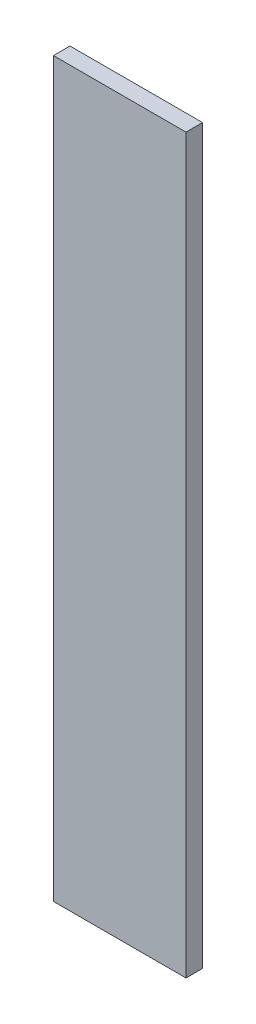
ISO-10303-21;
HEADER;
FILE_DESCRIPTION(('STEP AP214'),'2;1');
FILE_NAME('part.step','',(''),(''),'','','');
FILE_SCHEMA(('AUTOMOTIVE_DESIGN { 1 0 10303 214 1 1 1 1 }'));
ENDSEC;
DATA;
#1=APPLICATION_CONTEXT('core data for automotive mechanical design processes');
#2=APPLICATION_PROTOCOL_DEFINITION('international standard','automotive_design',2000,#1);
#3=PRODUCT_CONTEXT('',#1,'mechanical');
#4=PRODUCT('Part','Part','',(#3));
#5=PRODUCT_RELATED_PRODUCT_CATEGORY('part','',(#4));
#6=PRODUCT_DEFINITION_FORMATION('','',#4);
#7=PRODUCT_DEFINITION_CONTEXT('part definition',#1,'design');
#8=PRODUCT_DEFINITION('design','',#6,#7);
#9=PRODUCT_DEFINITION_SHAPE('','',#8);
#10=(LENGTH_UNIT() NAMED_UNIT(*) SI_UNIT(.MILLI.,.METRE.));
#11=(NAMED_UNIT(*) PLANE_ANGLE_UNIT() SI_UNIT($,.RADIAN.));
#12=(NAMED_UNIT(*) SI_UNIT($,.STERADIAN.) SOLID_ANGLE_UNIT());
#13=UNCERTAINTY_MEASURE_WITH_UNIT(LENGTH_MEASURE(1.E-05),#10,'distance_accuracy_value','');
#14=(GEOMETRIC_REPRESENTATION_CONTEXT(3) GLOBAL_UNCERTAINTY_ASSIGNED_CONTEXT((#13)) GLOBAL_UNIT_ASSIGNED_CONTEXT((#10,
#11,#12)) REPRESENTATION_CONTEXT('',''));
#15=CARTESIAN_POINT('',(0.,0.,0.));
#16=DIRECTION('',(0.,0.,1.));
#17=DIRECTION('',(1.,0.,0.));
#18=AXIS2_PLACEMENT_3D('',#15,#16,#17);
#19=CARTESIAN_POINT('',(40.,221.,5.));
#20=DIRECTION('',(-1.,0.,0.));
#21=DIRECTION('',(0.,-1.,0.));
#22=AXIS2_PLACEMENT_3D('',#19,#20,#21);
#23=PLANE('',#22);
#24=DIRECTION('',(0.,1.,0.));
#25=VECTOR('',#24,1.);
#26=CARTESIAN_POINT('',(40.,221.,-5.));
#27=LINE('',#26,#25);
#28=CARTESIAN_POINT('',(40.,-221.,-5.));
#29=VERTEX_POINT('',#28);
#30=CARTESIAN_POINT('',(40.,221.,-5.));
#31=VERTEX_POINT('',#30);
#32=EDGE_CURVE('E107',#29,#31,#27,.T.);
#33=ORIENTED_EDGE('',*,*,#32,.T.);
#34=DIRECTION('',(0.,0.,-1.));
#35=VECTOR('',#34,1.);
#36=CARTESIAN_POINT('',(40.,221.,5.));
#37=LINE('',#36,#35);
#38=CARTESIAN_POINT('',(40.,221.,5.));
#39=VERTEX_POINT('',#38);
#40=EDGE_CURVE('E11',#39,#31,#37,.T.);
#41=ORIENTED_EDGE('',*,*,#40,.F.);
#42=DIRECTION('',(0.,1.,0.));
#43=VECTOR('',#42,1.);
#44=CARTESIAN_POINT('',(40.,221.,5.));
#45=LINE('',#44,#43);
#46=CARTESIAN_POINT('',(40.,-221.,5.));
#47=VERTEX_POINT('',#46);
#48=EDGE_CURVE('E91',#47,#39,#45,.T.);
#49=ORIENTED_EDGE('',*,*,#48,.F.);
#50=DIRECTION('',(0.,0.,-1.));
#51=VECTOR('',#50,1.);
#52=CARTESIAN_POINT('',(40.,-221.,5.));
#53=LINE('',#52,#51);
#54=EDGE_CURVE('E103',#47,#29,#53,.T.);
#55=ORIENTED_EDGE('',*,*,#54,.T.);
#56=EDGE_LOOP('',(#33,#41,#49,#55));
#57=FACE_BOUND('',#56,.T.);
#58=ADVANCED_FACE('F39',(#57),#23,.F.);
#59=CARTESIAN_POINT('',(-40.,221.,5.));
#60=DIRECTION('',(0.,-1.,0.));
#61=DIRECTION('',(0.,0.,-1.));
#62=AXIS2_PLACEMENT_3D('',#59,#60,#61);
#63=PLANE('',#62);
#64=DIRECTION('',(-1.,0.,0.));
#65=VECTOR('',#64,1.);
#66=CARTESIAN_POINT('',(-40.,221.,-5.));
#67=LINE('',#66,#65);
#68=CARTESIAN_POINT('',(-40.,221.,-5.));
#69=VERTEX_POINT('',#68);
#70=EDGE_CURVE('E96',#31,#69,#67,.T.);
#71=ORIENTED_EDGE('',*,*,#70,.T.);
#72=DIRECTION('',(0.,0.,-1.));
#73=VECTOR('',#72,1.);
#74=CARTESIAN_POINT('',(-40.,221.,5.));
#75=LINE('',#74,#73);
#76=CARTESIAN_POINT('',(-40.,221.,5.));
#77=VERTEX_POINT('',#76);
#78=EDGE_CURVE('E48',#77,#69,#75,.T.);
#79=ORIENTED_EDGE('',*,*,#78,.F.);
#80=DIRECTION('',(-1.,0.,0.));
#81=VECTOR('',#80,1.);
#82=CARTESIAN_POINT('',(-40.,221.,5.));
#83=LINE('',#82,#81);
#84=EDGE_CURVE('E86',#39,#77,#83,.T.);
#85=ORIENTED_EDGE('',*,*,#84,.F.);
#86=ORIENTED_EDGE('',*,*,#40,.T.);
#87=EDGE_LOOP('',(#71,#79,#85,#86));
#88=FACE_BOUND('',#87,.T.);
#89=ADVANCED_FACE('F95',(#88),#63,.F.);
#90=CARTESIAN_POINT('',(-40.,221.,5.));
#91=DIRECTION('',(1.,0.,0.));
#92=DIRECTION('',(0.,1.,0.));
#93=AXIS2_PLACEMENT_3D('',#90,#91,#92);
#94=PLANE('',#93);
#95=DIRECTION('',(0.,-1.,0.));
#96=VECTOR('',#95,1.);
#97=CARTESIAN_POINT('',(-40.,221.,-5.));
#98=LINE('',#97,#96);
#99=CARTESIAN_POINT('',(-40.,-221.,-5.));
#100=VERTEX_POINT('',#99);
#101=EDGE_CURVE('E73',#69,#100,#98,.T.);
#102=ORIENTED_EDGE('',*,*,#101,.T.);
#103=DIRECTION('',(0.,0.,-1.));
#104=VECTOR('',#103,1.);
#105=CARTESIAN_POINT('',(-40.,-221.,5.));
#106=LINE('',#105,#104);
#107=CARTESIAN_POINT('',(-40.,-221.,5.));
#108=VERTEX_POINT('',#107);
#109=EDGE_CURVE('E98',#108,#100,#106,.T.);
#110=ORIENTED_EDGE('',*,*,#109,.F.);
#111=DIRECTION('',(0.,-1.,0.));
#112=VECTOR('',#111,1.);
#113=CARTESIAN_POINT('',(-40.,221.,5.));
#114=LINE('',#113,#112);
#115=EDGE_CURVE('E89',#77,#108,#114,.T.);
#116=ORIENTED_EDGE('',*,*,#115,.F.);
#117=ORIENTED_EDGE('',*,*,#78,.T.);
#118=EDGE_LOOP('',(#102,#110,#116,#117));
#119=FACE_BOUND('',#118,.T.);
#120=ADVANCED_FACE('F99',(#119),#94,.F.);
#121=CARTESIAN_POINT('',(-40.,-221.,5.));
#122=DIRECTION('',(0.,1.,0.));
#123=DIRECTION('',(0.,0.,1.));
#124=AXIS2_PLACEMENT_3D('',#121,#122,#123);
#125=PLANE('',#124);
#126=DIRECTION('',(1.,0.,0.));
#127=VECTOR('',#126,1.);
#128=CARTESIAN_POINT('',(-40.,-221.,-5.));
#129=LINE('',#128,#127);
#130=EDGE_CURVE('E79',#100,#29,#129,.T.);
#131=ORIENTED_EDGE('',*,*,#130,.T.);
#132=ORIENTED_EDGE('',*,*,#54,.F.);
#133=DIRECTION('',(1.,0.,0.));
#134=VECTOR('',#133,1.);
#135=CARTESIAN_POINT('',(-40.,-221.,5.));
#136=LINE('',#135,#134);
#137=EDGE_CURVE('E56',#108,#47,#136,.T.);
#138=ORIENTED_EDGE('',*,*,#137,.F.);
#139=ORIENTED_EDGE('',*,*,#109,.T.);
#140=EDGE_LOOP('',(#131,#132,#138,#139));
#141=FACE_BOUND('',#140,.T.);
#142=ADVANCED_FACE('F120',(#141),#125,.F.);
#143=CARTESIAN_POINT('',(0.,0.,5.));
#144=DIRECTION('',(0.,0.,1.));
#145=DIRECTION('',(1.,0.,0.));
#146=AXIS2_PLACEMENT_3D('',#143,#144,#145);
#147=PLANE('',#146);
#148=ORIENTED_EDGE('',*,*,#48,.T.);
#149=ORIENTED_EDGE('',*,*,#84,.T.);
#150=ORIENTED_EDGE('',*,*,#115,.T.);
#151=ORIENTED_EDGE('',*,*,#137,.T.);
#152=EDGE_LOOP('',(#148,#149,#150,#151));
#153=FACE_BOUND('',#152,.T.);
#154=ADVANCED_FACE('F87',(#153),#147,.T.);
#155=CARTESIAN_POINT('',(0.,0.,-5.));
#156=DIRECTION('',(0.,0.,1.));
#157=DIRECTION('',(1.,0.,0.));
#158=AXIS2_PLACEMENT_3D('',#155,#156,#157);
#159=PLANE('',#158);
#160=ORIENTED_EDGE('',*,*,#32,.F.);
#161=ORIENTED_EDGE('',*,*,#130,.F.);
#162=ORIENTED_EDGE('',*,*,#101,.F.);
#163=ORIENTED_EDGE('',*,*,#70,.F.);
#164=EDGE_LOOP('',(#160,#161,#162,#163));
#165=FACE_BOUND('',#164,.T.);
#166=ADVANCED_FACE('F123',(#165),#159,.F.);
#167=CLOSED_SHELL('',(#58,#89,#120,#142,#154,#166));
#168=MANIFOLD_SOLID_BREP('B2',#167);
#169=ADVANCED_BREP_SHAPE_REPRESENTATION('',(#18,#168),#14);
#170=SHAPE_DEFINITION_REPRESENTATION(#9,#169);
ENDSEC;
END-ISO-10303-21;
